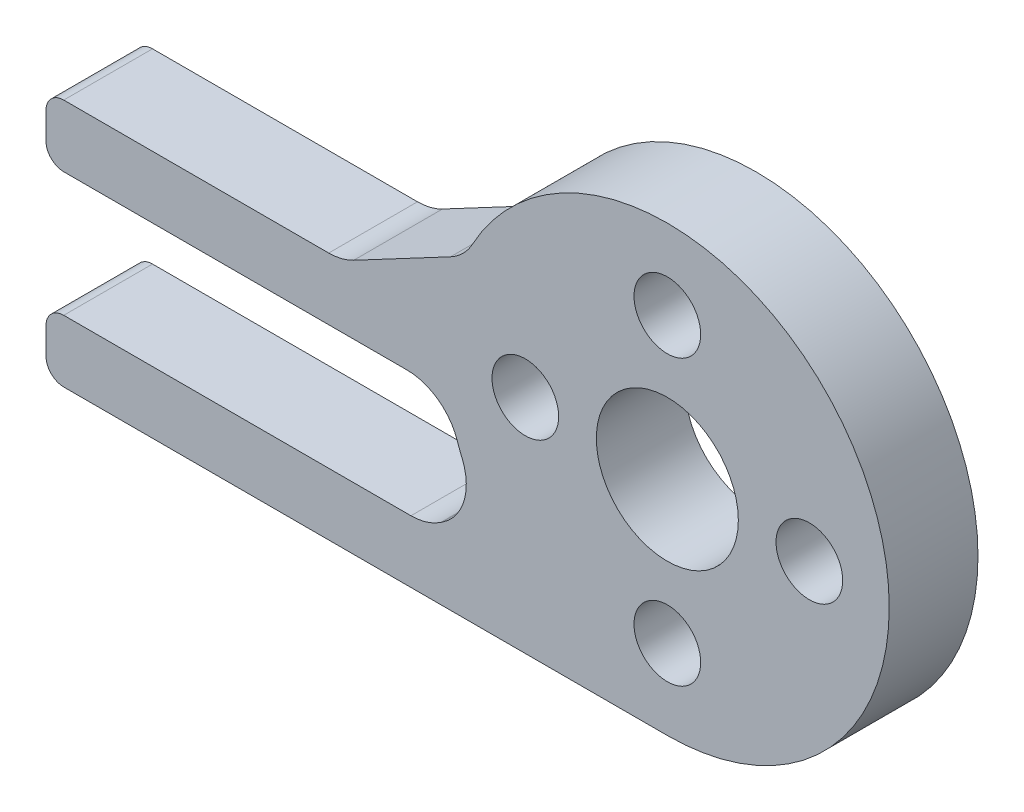
ISO-10303-21;
HEADER;
FILE_DESCRIPTION(('STEP AP214'),'2;1');
FILE_NAME('part.step','',(''),(''),'','','');
FILE_SCHEMA(('AUTOMOTIVE_DESIGN { 1 0 10303 214 1 1 1 1 }'));
ENDSEC;
DATA;
#1=APPLICATION_CONTEXT('core data for automotive mechanical design processes');
#2=APPLICATION_PROTOCOL_DEFINITION('international standard','automotive_design',2000,#1);
#3=PRODUCT_CONTEXT('',#1,'mechanical');
#4=PRODUCT('Part','Part','',(#3));
#5=PRODUCT_RELATED_PRODUCT_CATEGORY('part','',(#4));
#6=PRODUCT_DEFINITION_FORMATION('','',#4);
#7=PRODUCT_DEFINITION_CONTEXT('part definition',#1,'design');
#8=PRODUCT_DEFINITION('design','',#6,#7);
#9=PRODUCT_DEFINITION_SHAPE('','',#8);
#10=(LENGTH_UNIT() NAMED_UNIT(*) SI_UNIT(.MILLI.,.METRE.));
#11=(NAMED_UNIT(*) PLANE_ANGLE_UNIT() SI_UNIT($,.RADIAN.));
#12=(NAMED_UNIT(*) SI_UNIT($,.STERADIAN.) SOLID_ANGLE_UNIT());
#13=UNCERTAINTY_MEASURE_WITH_UNIT(LENGTH_MEASURE(1.E-05),#10,'distance_accuracy_value','');
#14=(GEOMETRIC_REPRESENTATION_CONTEXT(3) GLOBAL_UNCERTAINTY_ASSIGNED_CONTEXT((#13)) GLOBAL_UNIT_ASSIGNED_CONTEXT((#10,
#11,#12)) REPRESENTATION_CONTEXT('',''));
#15=CARTESIAN_POINT('',(0.,0.,0.));
#16=DIRECTION('',(0.,0.,1.));
#17=DIRECTION('',(1.,0.,0.));
#18=AXIS2_PLACEMENT_3D('',#15,#16,#17);
#19=CARTESIAN_POINT('',(0.,-2.,5.));
#20=DIRECTION('',(0.,1.,0.));
#21=DIRECTION('',(0.,0.,1.));
#22=AXIS2_PLACEMENT_3D('',#19,#20,#21);
#23=PLANE('',#22);
#24=DIRECTION('',(1.,0.,0.));
#25=VECTOR('',#24,1.);
#26=CARTESIAN_POINT('',(0.,-2.,5.));
#27=LINE('',#26,#25);
#28=CARTESIAN_POINT('',(-34.,-2.,5.));
#29=VERTEX_POINT('',#28);
#30=CARTESIAN_POINT('',(-14.6714007511212,-2.,5.));
#31=VERTEX_POINT('',#30);
#32=EDGE_CURVE('E334',#29,#31,#27,.T.);
#33=ORIENTED_EDGE('',*,*,#32,.F.);
#34=DIRECTION('',(0.,0.,-1.));
#35=VECTOR('',#34,1.);
#36=CARTESIAN_POINT('',(-34.,-2.,0.));
#37=LINE('',#36,#35);
#38=CARTESIAN_POINT('',(-34.,-2.,0.));
#39=VERTEX_POINT('',#38);
#40=EDGE_CURVE('E290',#29,#39,#37,.T.);
#41=ORIENTED_EDGE('',*,*,#40,.T.);
#42=DIRECTION('',(1.,0.,0.));
#43=VECTOR('',#42,1.);
#44=CARTESIAN_POINT('',(0.,-2.,0.));
#45=LINE('',#44,#43);
#46=CARTESIAN_POINT('',(-14.6714007511212,-2.,0.));
#47=VERTEX_POINT('',#46);
#48=EDGE_CURVE('E217',#39,#47,#45,.T.);
#49=ORIENTED_EDGE('',*,*,#48,.T.);
#50=DIRECTION('',(0.,0.,1.));
#51=VECTOR('',#50,1.);
#52=CARTESIAN_POINT('',(-14.6714007511212,-2.,5.));
#53=LINE('',#52,#51);
#54=EDGE_CURVE('E248',#47,#31,#53,.T.);
#55=ORIENTED_EDGE('',*,*,#54,.T.);
#56=EDGE_LOOP('',(#33,#41,#49,#55));
#57=FACE_BOUND('',#56,.T.);
#58=ADVANCED_FACE('F36',(#57),#23,.F.);
#59=CARTESIAN_POINT('',(0.,0.,5.));
#60=DIRECTION('',(0.,0.,-1.));
#61=DIRECTION('',(-1.,0.,0.));
#62=AXIS2_PLACEMENT_3D('',#59,#60,#61);
#63=CYLINDRICAL_SURFACE('',#62,12.5);
#64=CARTESIAN_POINT('',(0.,0.,5.));
#65=DIRECTION('',(0.,0.,1.));
#66=DIRECTION('',(1.,0.,0.));
#67=AXIS2_PLACEMENT_3D('',#64,#65,#66);
#68=CIRCLE('',#67,12.5);
#69=CARTESIAN_POINT('',(-11.8317747992913,-4.03225806451613,5.));
#70=VERTEX_POINT('',#69);
#71=CARTESIAN_POINT('',(-11.552219814128,-4.77453844534411,5.));
#72=VERTEX_POINT('',#71);
#73=EDGE_CURVE('E337',#70,#72,#68,.T.);
#74=ORIENTED_EDGE('',*,*,#73,.F.);
#75=DIRECTION('',(0.,0.,-1.));
#76=VECTOR('',#75,1.);
#77=CARTESIAN_POINT('',(-11.8317747992913,-4.03225806451613,5.));
#78=LINE('',#77,#76);
#79=CARTESIAN_POINT('',(-11.8317747992913,-4.03225806451613,0.));
#80=VERTEX_POINT('',#79);
#81=EDGE_CURVE('E245',#70,#80,#78,.T.);
#82=ORIENTED_EDGE('',*,*,#81,.T.);
#83=CARTESIAN_POINT('',(0.,0.,0.));
#84=DIRECTION('',(0.,0.,1.));
#85=DIRECTION('',(1.,0.,0.));
#86=AXIS2_PLACEMENT_3D('',#83,#84,#85);
#87=CIRCLE('',#86,12.5);
#88=CARTESIAN_POINT('',(-11.552219814128,-4.77453844534411,0.));
#89=VERTEX_POINT('',#88);
#90=EDGE_CURVE('E219',#80,#89,#87,.T.);
#91=ORIENTED_EDGE('',*,*,#90,.T.);
#92=DIRECTION('',(0.,0.,-1.));
#93=VECTOR('',#92,1.);
#94=CARTESIAN_POINT('',(-11.552219814128,-4.77453844534411,5.));
#95=LINE('',#94,#93);
#96=EDGE_CURVE('E243',#89,#72,#95,.F.);
#97=ORIENTED_EDGE('',*,*,#96,.T.);
#98=EDGE_LOOP('',(#74,#82,#91,#97));
#99=FACE_BOUND('',#98,.T.);
#100=ADVANCED_FACE('F373',(#99),#63,.T.);
#101=CARTESIAN_POINT('',(-0.0737973544000701,0.108951106767535,5.));
#102=DIRECTION('',(0.560805253983268,-0.827947744187254,0.));
#103=DIRECTION('',(0.827947744187254,0.560805253983268,0.));
#104=AXIS2_PLACEMENT_3D('',#101,#102,#103);
#105=PLANE('',#104);
#106=DIRECTION('',(-0.827947744187254,-0.560805253983268,0.));
#107=VECTOR('',#106,1.);
#108=CARTESIAN_POINT('',(-0.0737973544000701,0.108951106767535,5.));
#109=LINE('',#108,#107);
#110=CARTESIAN_POINT('',(-12.6423368075689,-8.40427090478847,5.));
#111=VERTEX_POINT('',#110);
#112=CARTESIAN_POINT('',(-12.7598138262161,-8.48384323256177,5.));
#113=VERTEX_POINT('',#112);
#114=EDGE_CURVE('E341',#111,#113,#109,.T.);
#115=ORIENTED_EDGE('',*,*,#114,.F.);
#116=DIRECTION('',(0.,0.,1.));
#117=VECTOR('',#116,1.);
#118=CARTESIAN_POINT('',(-12.6423368075689,-8.40427090478846,0.));
#119=LINE('',#118,#117);
#120=CARTESIAN_POINT('',(-12.6423368075689,-8.40427090478847,0.));
#121=VERTEX_POINT('',#120);
#122=EDGE_CURVE('E253',#111,#121,#119,.F.);
#123=ORIENTED_EDGE('',*,*,#122,.T.);
#124=DIRECTION('',(-0.827947744187254,-0.560805253983268,0.));
#125=VECTOR('',#124,1.);
#126=CARTESIAN_POINT('',(-0.0737973544000701,0.108951106767535,0.));
#127=LINE('',#126,#125);
#128=CARTESIAN_POINT('',(-12.7598138262161,-8.48384323256177,0.));
#129=VERTEX_POINT('',#128);
#130=EDGE_CURVE('E222',#121,#129,#127,.T.);
#131=ORIENTED_EDGE('',*,*,#130,.T.);
#132=DIRECTION('',(0.,0.,-1.));
#133=VECTOR('',#132,1.);
#134=CARTESIAN_POINT('',(-12.7598138262161,-8.48384323256177,5.));
#135=LINE('',#134,#133);
#136=EDGE_CURVE('E251',#129,#113,#135,.F.);
#137=ORIENTED_EDGE('',*,*,#136,.T.);
#138=EDGE_LOOP('',(#115,#123,#131,#137));
#139=FACE_BOUND('',#138,.T.);
#140=ADVANCED_FACE('F364',(#139),#105,.F.);
#141=CARTESIAN_POINT('',(0.,-9.00000000000001,5.));
#142=DIRECTION('',(0.,1.,0.));
#143=DIRECTION('',(0.,0.,1.));
#144=AXIS2_PLACEMENT_3D('',#141,#142,#143);
#145=PLANE('',#144);
#146=DIRECTION('',(1.,0.,0.));
#147=VECTOR('',#146,1.);
#148=CARTESIAN_POINT('',(0.,-9.00000000000001,0.));
#149=LINE('',#148,#147);
#150=CARTESIAN_POINT('',(-34.,-9.00000000000001,0.));
#151=VERTEX_POINT('',#150);
#152=CARTESIAN_POINT('',(-14.4422295881659,-9.00000000000001,0.));
#153=VERTEX_POINT('',#152);
#154=EDGE_CURVE('E225',#151,#153,#149,.T.);
#155=ORIENTED_EDGE('',*,*,#154,.F.);
#156=DIRECTION('',(0.,0.,-1.));
#157=VECTOR('',#156,1.);
#158=CARTESIAN_POINT('',(-34.,-9.00000000000001,5.));
#159=LINE('',#158,#157);
#160=CARTESIAN_POINT('',(-34.,-9.00000000000001,5.));
#161=VERTEX_POINT('',#160);
#162=EDGE_CURVE('E307',#151,#161,#159,.F.);
#163=ORIENTED_EDGE('',*,*,#162,.T.);
#164=DIRECTION('',(1.,0.,0.));
#165=VECTOR('',#164,1.);
#166=CARTESIAN_POINT('',(0.,-9.00000000000001,5.));
#167=LINE('',#166,#165);
#168=CARTESIAN_POINT('',(-14.4422295881659,-9.00000000000001,5.));
#169=VERTEX_POINT('',#168);
#170=EDGE_CURVE('E196',#161,#169,#167,.T.);
#171=ORIENTED_EDGE('',*,*,#170,.T.);
#172=DIRECTION('',(0.,0.,-1.));
#173=VECTOR('',#172,1.);
#174=CARTESIAN_POINT('',(-14.4422295881659,-9.00000000000001,5.));
#175=LINE('',#174,#173);
#176=EDGE_CURVE('E256',#169,#153,#175,.T.);
#177=ORIENTED_EDGE('',*,*,#176,.T.);
#178=EDGE_LOOP('',(#155,#163,#171,#177));
#179=FACE_BOUND('',#178,.T.);
#180=ADVANCED_FACE('F352',(#179),#145,.T.);
#181=CARTESIAN_POINT('',(-35.,0.,5.));
#182=DIRECTION('',(-1.,0.,0.));
#183=DIRECTION('',(0.,0.,1.));
#184=AXIS2_PLACEMENT_3D('',#181,#182,#183);
#185=PLANE('',#184);
#186=DIRECTION('',(0.,1.,0.));
#187=VECTOR('',#186,1.);
#188=CARTESIAN_POINT('',(-35.,0.,0.));
#189=LINE('',#188,#187);
#190=CARTESIAN_POINT('',(-35.,-11.5,0.));
#191=VERTEX_POINT('',#190);
#192=CARTESIAN_POINT('',(-35.,-10.,0.));
#193=VERTEX_POINT('',#192);
#194=EDGE_CURVE('E227',#191,#193,#189,.T.);
#195=ORIENTED_EDGE('',*,*,#194,.F.);
#196=DIRECTION('',(0.,0.,-1.));
#197=VECTOR('',#196,1.);
#198=CARTESIAN_POINT('',(-35.,-11.5,5.));
#199=LINE('',#198,#197);
#200=CARTESIAN_POINT('',(-35.,-11.5,5.));
#201=VERTEX_POINT('',#200);
#202=EDGE_CURVE('E315',#191,#201,#199,.F.);
#203=ORIENTED_EDGE('',*,*,#202,.T.);
#204=DIRECTION('',(0.,1.,0.));
#205=VECTOR('',#204,1.);
#206=CARTESIAN_POINT('',(-35.,0.,5.));
#207=LINE('',#206,#205);
#208=CARTESIAN_POINT('',(-35.,-10.,5.));
#209=VERTEX_POINT('',#208);
#210=EDGE_CURVE('E194',#201,#209,#207,.T.);
#211=ORIENTED_EDGE('',*,*,#210,.T.);
#212=DIRECTION('',(0.,0.,-1.));
#213=VECTOR('',#212,1.);
#214=CARTESIAN_POINT('',(-35.,-10.,5.));
#215=LINE('',#214,#213);
#216=EDGE_CURVE('E304',#209,#193,#215,.T.);
#217=ORIENTED_EDGE('',*,*,#216,.T.);
#218=EDGE_LOOP('',(#195,#203,#211,#217));
#219=FACE_BOUND('',#218,.T.);
#220=ADVANCED_FACE('F450',(#219),#185,.T.);
#221=CARTESIAN_POINT('',(0.,-12.5,5.));
#222=DIRECTION('',(0.,-1.,0.));
#223=DIRECTION('',(0.,0.,-1.));
#224=AXIS2_PLACEMENT_3D('',#221,#222,#223);
#225=PLANE('',#224);
#226=DIRECTION('',(-1.,0.,0.));
#227=VECTOR('',#226,1.);
#228=CARTESIAN_POINT('',(0.,-12.5,5.));
#229=LINE('',#228,#227);
#230=CARTESIAN_POINT('',(0.,-12.5,5.));
#231=VERTEX_POINT('',#230);
#232=CARTESIAN_POINT('',(-34.,-12.5,5.));
#233=VERTEX_POINT('',#232);
#234=EDGE_CURVE('E172',#231,#233,#229,.T.);
#235=ORIENTED_EDGE('',*,*,#234,.T.);
#236=DIRECTION('',(0.,0.,-1.));
#237=VECTOR('',#236,1.);
#238=CARTESIAN_POINT('',(-34.,-12.5,5.));
#239=LINE('',#238,#237);
#240=CARTESIAN_POINT('',(-34.,-12.5,0.));
#241=VERTEX_POINT('',#240);
#242=EDGE_CURVE('E309',#233,#241,#239,.T.);
#243=ORIENTED_EDGE('',*,*,#242,.T.);
#244=DIRECTION('',(-1.,0.,0.));
#245=VECTOR('',#244,1.);
#246=CARTESIAN_POINT('',(0.,-12.5,0.));
#247=LINE('',#246,#245);
#248=CARTESIAN_POINT('',(0.,-12.5,0.));
#249=VERTEX_POINT('',#248);
#250=EDGE_CURVE('E175',#249,#241,#247,.T.);
#251=ORIENTED_EDGE('',*,*,#250,.F.);
#252=DIRECTION('',(0.,0.,-1.));
#253=VECTOR('',#252,1.);
#254=CARTESIAN_POINT('',(0.,-12.5,5.));
#255=LINE('',#254,#253);
#256=EDGE_CURVE('E167',#231,#249,#255,.T.);
#257=ORIENTED_EDGE('',*,*,#256,.F.);
#258=EDGE_LOOP('',(#235,#243,#251,#257));
#259=FACE_BOUND('',#258,.T.);
#260=ADVANCED_FACE('F169',(#259),#225,.T.);
#261=CARTESIAN_POINT('',(0.,0.,5.));
#262=DIRECTION('',(0.,0.,-1.));
#263=DIRECTION('',(-1.,0.,0.));
#264=AXIS2_PLACEMENT_3D('',#261,#262,#263);
#265=CYLINDRICAL_SURFACE('',#264,12.5);
#266=CARTESIAN_POINT('',(0.,0.,0.));
#267=DIRECTION('',(0.,0.,1.));
#268=DIRECTION('',(1.,0.,0.));
#269=AXIS2_PLACEMENT_3D('',#266,#267,#268);
#270=CIRCLE('',#269,12.5);
#271=CARTESIAN_POINT('',(-10.9853032448127,5.96431996287154,0.));
#272=VERTEX_POINT('',#271);
#273=EDGE_CURVE('E230',#249,#272,#270,.T.);
#274=ORIENTED_EDGE('',*,*,#273,.T.);
#275=DIRECTION('',(0.,0.,-1.));
#276=VECTOR('',#275,1.);
#277=CARTESIAN_POINT('',(-10.9853032448127,5.96431996287154,5.));
#278=LINE('',#277,#276);
#279=CARTESIAN_POINT('',(-10.9853032448127,5.96431996287154,5.));
#280=VERTEX_POINT('',#279);
#281=EDGE_CURVE('E187',#272,#280,#278,.F.);
#282=ORIENTED_EDGE('',*,*,#281,.T.);
#283=CARTESIAN_POINT('',(0.,0.,5.));
#284=DIRECTION('',(0.,0.,1.));
#285=DIRECTION('',(1.,0.,0.));
#286=AXIS2_PLACEMENT_3D('',#283,#284,#285);
#287=CIRCLE('',#286,12.5);
#288=EDGE_CURVE('E184',#231,#280,#287,.T.);
#289=ORIENTED_EDGE('',*,*,#288,.F.);
#290=ORIENTED_EDGE('',*,*,#256,.T.);
#291=EDGE_LOOP('',(#274,#282,#289,#290));
#292=FACE_BOUND('',#291,.T.);
#293=ADVANCED_FACE('F185',(#292),#265,.T.);
#294=CARTESIAN_POINT('',(0.,1.5,5.));
#295=DIRECTION('',(0.,1.,0.));
#296=DIRECTION('',(0.,0.,1.));
#297=AXIS2_PLACEMENT_3D('',#294,#295,#296);
#298=PLANE('',#297);
#299=DIRECTION('',(1.,0.,0.));
#300=VECTOR('',#299,1.);
#301=CARTESIAN_POINT('',(0.,1.5,0.));
#302=LINE('',#301,#300);
#303=CARTESIAN_POINT('',(-34.,1.5,0.));
#304=VERTEX_POINT('',#303);
#305=CARTESIAN_POINT('',(-19.0743537304339,1.5,0.));
#306=VERTEX_POINT('',#305);
#307=EDGE_CURVE('E232',#304,#306,#302,.T.);
#308=ORIENTED_EDGE('',*,*,#307,.F.);
#309=DIRECTION('',(0.,0.,-1.));
#310=VECTOR('',#309,1.);
#311=CARTESIAN_POINT('',(-34.,1.5,5.));
#312=LINE('',#311,#310);
#313=CARTESIAN_POINT('',(-34.,1.5,5.));
#314=VERTEX_POINT('',#313);
#315=EDGE_CURVE('E11',#304,#314,#312,.F.);
#316=ORIENTED_EDGE('',*,*,#315,.T.);
#317=DIRECTION('',(1.,0.,0.));
#318=VECTOR('',#317,1.);
#319=CARTESIAN_POINT('',(0.,1.5,5.));
#320=LINE('',#319,#318);
#321=CARTESIAN_POINT('',(-19.0743537304339,1.5,5.));
#322=VERTEX_POINT('',#321);
#323=EDGE_CURVE('E188',#314,#322,#320,.T.);
#324=ORIENTED_EDGE('',*,*,#323,.T.);
#325=DIRECTION('',(0.,0.,-1.));
#326=VECTOR('',#325,1.);
#327=CARTESIAN_POINT('',(-19.0743537304339,1.5,5.));
#328=LINE('',#327,#326);
#329=EDGE_CURVE('E278',#322,#306,#328,.T.);
#330=ORIENTED_EDGE('',*,*,#329,.T.);
#331=EDGE_LOOP('',(#308,#316,#324,#330));
#332=FACE_BOUND('',#331,.T.);
#333=ADVANCED_FACE('F399',(#332),#298,.T.);
#334=CARTESIAN_POINT('',(0.,0.,5.));
#335=DIRECTION('',(0.,0.,-1.));
#336=DIRECTION('',(-1.,0.,0.));
#337=AXIS2_PLACEMENT_3D('',#334,#335,#336);
#338=CYLINDRICAL_SURFACE('',#337,4.);
#339=CARTESIAN_POINT('',(0.,0.,5.));
#340=DIRECTION('',(0.,0.,1.));
#341=DIRECTION('',(1.,0.,0.));
#342=AXIS2_PLACEMENT_3D('',#339,#340,#341);
#343=CIRCLE('',#342,4.);
#344=CARTESIAN_POINT('',(4.,0.,5.));
#345=VERTEX_POINT('',#344);
#346=EDGE_CURVE('E338',#345,#345,#343,.T.);
#347=ORIENTED_EDGE('',*,*,#346,.T.);
#348=EDGE_LOOP('',(#347));
#349=FACE_BOUND('',#348,.T.);
#350=CARTESIAN_POINT('',(0.,0.,0.));
#351=DIRECTION('',(0.,0.,1.));
#352=DIRECTION('',(1.,0.,0.));
#353=AXIS2_PLACEMENT_3D('',#350,#351,#352);
#354=CIRCLE('',#353,4.);
#355=CARTESIAN_POINT('',(4.,0.,0.));
#356=VERTEX_POINT('',#355);
#357=EDGE_CURVE('E214',#356,#356,#354,.T.);
#358=ORIENTED_EDGE('',*,*,#357,.F.);
#359=EDGE_LOOP('',(#358));
#360=FACE_BOUND('',#359,.T.);
#361=ADVANCED_FACE('F395',(#349,#360),#338,.F.);
#362=CARTESIAN_POINT('',(-7.99999999999977,-2.27373675443232E-13,5.));
#363=DIRECTION('',(0.,0.,-1.));
#364=DIRECTION('',(-1.,0.,0.));
#365=AXIS2_PLACEMENT_3D('',#362,#363,#364);
#366=CYLINDRICAL_SURFACE('',#365,1.87800000000036);
#367=CARTESIAN_POINT('',(-7.99999999999977,-2.27373675443232E-13,5.));
#368=DIRECTION('',(0.,0.,1.));
#369=DIRECTION('',(1.,0.,0.));
#370=AXIS2_PLACEMENT_3D('',#367,#368,#369);
#371=CIRCLE('',#370,1.87800000000036);
#372=CARTESIAN_POINT('',(-6.12199999999941,-2.27373675443232E-13,5.));
#373=VERTEX_POINT('',#372);
#374=EDGE_CURVE('E344',#373,#373,#371,.T.);
#375=ORIENTED_EDGE('',*,*,#374,.T.);
#376=EDGE_LOOP('',(#375));
#377=FACE_BOUND('',#376,.T.);
#378=CARTESIAN_POINT('',(-7.99999999999977,-2.27373675443232E-13,0.));
#379=DIRECTION('',(0.,0.,1.));
#380=DIRECTION('',(1.,0.,0.));
#381=AXIS2_PLACEMENT_3D('',#378,#379,#380);
#382=CIRCLE('',#381,1.87800000000036);
#383=CARTESIAN_POINT('',(-6.12199999999941,-2.27373675443232E-13,0.));
#384=VERTEX_POINT('',#383);
#385=EDGE_CURVE('E211',#384,#384,#382,.T.);
#386=ORIENTED_EDGE('',*,*,#385,.F.);
#387=EDGE_LOOP('',(#386));
#388=FACE_BOUND('',#387,.T.);
#389=ADVANCED_FACE('F398',(#377,#388),#366,.F.);
#390=CARTESIAN_POINT('',(4.52787916007828E-13,-8.,5.));
#391=DIRECTION('',(0.,0.,-1.));
#392=DIRECTION('',(-1.,0.,0.));
#393=AXIS2_PLACEMENT_3D('',#390,#391,#392);
#394=CYLINDRICAL_SURFACE('',#393,1.87800000000049);
#395=CARTESIAN_POINT('',(4.52787916007828E-13,-8.,5.));
#396=DIRECTION('',(0.,0.,1.));
#397=DIRECTION('',(1.,0.,0.));
#398=AXIS2_PLACEMENT_3D('',#395,#396,#397);
#399=CIRCLE('',#398,1.87800000000049);
#400=CARTESIAN_POINT('',(1.87800000000094,-8.,5.));
#401=VERTEX_POINT('',#400);
#402=EDGE_CURVE('E650',#401,#401,#399,.T.);
#403=ORIENTED_EDGE('',*,*,#402,.T.);
#404=EDGE_LOOP('',(#403));
#405=FACE_BOUND('',#404,.T.);
#406=CARTESIAN_POINT('',(4.52787916007828E-13,-8.,0.));
#407=DIRECTION('',(0.,0.,1.));
#408=DIRECTION('',(1.,0.,0.));
#409=AXIS2_PLACEMENT_3D('',#406,#407,#408);
#410=CIRCLE('',#409,1.87800000000049);
#411=CARTESIAN_POINT('',(1.87800000000094,-8.,0.));
#412=VERTEX_POINT('',#411);
#413=EDGE_CURVE('E208',#412,#412,#410,.T.);
#414=ORIENTED_EDGE('',*,*,#413,.F.);
#415=EDGE_LOOP('',(#414));
#416=FACE_BOUND('',#415,.T.);
#417=ADVANCED_FACE('F403',(#405,#416),#394,.F.);
#418=CARTESIAN_POINT('',(8.00000000000023,2.26393958003914E-13,5.));
#419=DIRECTION('',(0.,0.,-1.));
#420=DIRECTION('',(-1.,0.,0.));
#421=AXIS2_PLACEMENT_3D('',#418,#419,#420);
#422=CYLINDRICAL_SURFACE('',#421,1.87800000000018);
#423=CARTESIAN_POINT('',(8.00000000000023,2.26393958003914E-13,5.));
#424=DIRECTION('',(0.,0.,1.));
#425=DIRECTION('',(1.,0.,0.));
#426=AXIS2_PLACEMENT_3D('',#423,#424,#425);
#427=CIRCLE('',#426,1.87800000000018);
#428=CARTESIAN_POINT('',(9.8780000000004,2.26393958003914E-13,5.));
#429=VERTEX_POINT('',#428);
#430=EDGE_CURVE('E646',#429,#429,#427,.T.);
#431=ORIENTED_EDGE('',*,*,#430,.T.);
#432=EDGE_LOOP('',(#431));
#433=FACE_BOUND('',#432,.T.);
#434=CARTESIAN_POINT('',(8.00000000000023,2.26393958003914E-13,0.));
#435=DIRECTION('',(0.,0.,1.));
#436=DIRECTION('',(1.,0.,0.));
#437=AXIS2_PLACEMENT_3D('',#434,#435,#436);
#438=CIRCLE('',#437,1.87800000000018);
#439=CARTESIAN_POINT('',(9.8780000000004,2.26393958003914E-13,0.));
#440=VERTEX_POINT('',#439);
#441=EDGE_CURVE('E205',#440,#440,#438,.T.);
#442=ORIENTED_EDGE('',*,*,#441,.F.);
#443=EDGE_LOOP('',(#442));
#444=FACE_BOUND('',#443,.T.);
#445=ADVANCED_FACE('F407',(#433,#444),#422,.F.);
#446=CARTESIAN_POINT('',(0.,8.,5.));
#447=DIRECTION('',(0.,0.,-1.));
#448=DIRECTION('',(-1.,0.,0.));
#449=AXIS2_PLACEMENT_3D('',#446,#447,#448);
#450=CYLINDRICAL_SURFACE('',#449,1.878);
#451=CARTESIAN_POINT('',(0.,8.,5.));
#452=DIRECTION('',(0.,0.,1.));
#453=DIRECTION('',(1.,0.,0.));
#454=AXIS2_PLACEMENT_3D('',#451,#452,#453);
#455=CIRCLE('',#454,1.878);
#456=CARTESIAN_POINT('',(1.878,8.,5.));
#457=VERTEX_POINT('',#456);
#458=EDGE_CURVE('E236',#457,#457,#455,.T.);
#459=ORIENTED_EDGE('',*,*,#458,.T.);
#460=EDGE_LOOP('',(#459));
#461=FACE_BOUND('',#460,.T.);
#462=CARTESIAN_POINT('',(0.,8.,0.));
#463=DIRECTION('',(0.,0.,1.));
#464=DIRECTION('',(1.,0.,0.));
#465=AXIS2_PLACEMENT_3D('',#462,#463,#464);
#466=CIRCLE('',#465,1.878);
#467=CARTESIAN_POINT('',(1.878,8.,0.));
#468=VERTEX_POINT('',#467);
#469=EDGE_CURVE('E202',#468,#468,#466,.T.);
#470=ORIENTED_EDGE('',*,*,#469,.F.);
#471=EDGE_LOOP('',(#470));
#472=FACE_BOUND('',#471,.T.);
#473=ADVANCED_FACE('F411',(#461,#472),#450,.F.);
#474=CARTESIAN_POINT('',(-35.,0.,5.));
#475=DIRECTION('',(-1.,0.,0.));
#476=DIRECTION('',(0.,0.,1.));
#477=AXIS2_PLACEMENT_3D('',#474,#475,#476);
#478=PLANE('',#477);
#479=DIRECTION('',(0.,1.,0.));
#480=VECTOR('',#479,1.);
#481=CARTESIAN_POINT('',(-35.,0.,5.));
#482=LINE('',#481,#480);
#483=CARTESIAN_POINT('',(-35.,-1.,5.));
#484=VERTEX_POINT('',#483);
#485=CARTESIAN_POINT('',(-35.,0.499999999999997,5.));
#486=VERTEX_POINT('',#485);
#487=EDGE_CURVE('E180',#484,#486,#482,.T.);
#488=ORIENTED_EDGE('',*,*,#487,.T.);
#489=DIRECTION('',(0.,0.,-1.));
#490=VECTOR('',#489,1.);
#491=CARTESIAN_POINT('',(-35.,0.499999999999997,5.));
#492=LINE('',#491,#490);
#493=CARTESIAN_POINT('',(-35.,0.499999999999997,0.));
#494=VERTEX_POINT('',#493);
#495=EDGE_CURVE('E44',#486,#494,#492,.T.);
#496=ORIENTED_EDGE('',*,*,#495,.T.);
#497=DIRECTION('',(0.,1.,0.));
#498=VECTOR('',#497,1.);
#499=CARTESIAN_POINT('',(-35.,0.,0.));
#500=LINE('',#499,#498);
#501=CARTESIAN_POINT('',(-35.,-1.,0.));
#502=VERTEX_POINT('',#501);
#503=EDGE_CURVE('E234',#502,#494,#500,.T.);
#504=ORIENTED_EDGE('',*,*,#503,.F.);
#505=DIRECTION('',(0.,0.,-1.));
#506=VECTOR('',#505,1.);
#507=CARTESIAN_POINT('',(-35.,-1.,5.));
#508=LINE('',#507,#506);
#509=EDGE_CURVE('E297',#502,#484,#508,.F.);
#510=ORIENTED_EDGE('',*,*,#509,.T.);
#511=EDGE_LOOP('',(#488,#496,#504,#510));
#512=FACE_BOUND('',#511,.T.);
#513=ADVANCED_FACE('F322',(#512),#478,.T.);
#514=CARTESIAN_POINT('',(0.,0.,5.));
#515=DIRECTION('',(0.,0.,1.));
#516=DIRECTION('',(1.,0.,0.));
#517=AXIS2_PLACEMENT_3D('',#514,#515,#516);
#518=PLANE('',#517);
#519=ORIENTED_EDGE('',*,*,#458,.F.);
#520=EDGE_LOOP('',(#519));
#521=FACE_BOUND('',#520,.T.);
#522=ORIENTED_EDGE('',*,*,#430,.F.);
#523=EDGE_LOOP('',(#522));
#524=FACE_BOUND('',#523,.T.);
#525=ORIENTED_EDGE('',*,*,#402,.F.);
#526=EDGE_LOOP('',(#525));
#527=FACE_BOUND('',#526,.T.);
#528=ORIENTED_EDGE('',*,*,#374,.F.);
#529=EDGE_LOOP('',(#528));
#530=FACE_BOUND('',#529,.T.);
#531=ORIENTED_EDGE('',*,*,#346,.F.);
#532=EDGE_LOOP('',(#531));
#533=FACE_BOUND('',#532,.T.);
#534=ORIENTED_EDGE('',*,*,#210,.F.);
#535=CARTESIAN_POINT('',(-34.,-11.5,5.));
#536=DIRECTION('',(0.,0.,1.));
#537=DIRECTION('',(1.,0.,0.));
#538=AXIS2_PLACEMENT_3D('',#535,#536,#537);
#539=CIRCLE('',#538,1.);
#540=EDGE_CURVE('E193',#201,#233,#539,.T.);
#541=ORIENTED_EDGE('',*,*,#540,.T.);
#542=ORIENTED_EDGE('',*,*,#234,.F.);
#543=ORIENTED_EDGE('',*,*,#288,.T.);
#544=CARTESIAN_POINT('',(-13.6217760235677,7.39575675396071,5.));
#545=DIRECTION('',(0.,0.,1.));
#546=DIRECTION('',(1.,0.,0.));
#547=AXIS2_PLACEMENT_3D('',#544,#545,#546);
#548=CIRCLE('',#547,3.);
#549=CARTESIAN_POINT('',(-12.214660961499,4.74622336068193,5.));
#550=VERTEX_POINT('',#549);
#551=EDGE_CURVE('E281',#280,#550,#548,.F.);
#552=ORIENTED_EDGE('',*,*,#551,.T.);
#553=DIRECTION('',(-0.883177797759594,-0.469038354022903,0.));
#554=VECTOR('',#553,1.);
#555=CARTESIAN_POINT('',(-18.3271512816037,1.5,5.));
#556=LINE('',#555,#554);
#557=CARTESIAN_POINT('',(-17.6672386683652,1.85046660672121,5.));
#558=VERTEX_POINT('',#557);
#559=EDGE_CURVE('E240',#550,#558,#556,.T.);
#560=ORIENTED_EDGE('',*,*,#559,.T.);
#561=CARTESIAN_POINT('',(-19.0743537304339,4.5,5.));
#562=DIRECTION('',(0.,0.,1.));
#563=DIRECTION('',(1.,0.,0.));
#564=AXIS2_PLACEMENT_3D('',#561,#562,#563);
#565=CIRCLE('',#564,3.);
#566=EDGE_CURVE('E287',#558,#322,#565,.F.);
#567=ORIENTED_EDGE('',*,*,#566,.T.);
#568=ORIENTED_EDGE('',*,*,#323,.F.);
#569=CARTESIAN_POINT('',(-34.,0.499999999999997,5.));
#570=DIRECTION('',(0.,0.,1.));
#571=DIRECTION('',(1.,0.,0.));
#572=AXIS2_PLACEMENT_3D('',#569,#570,#571);
#573=CIRCLE('',#572,1.);
#574=EDGE_CURVE('E56',#314,#486,#573,.T.);
#575=ORIENTED_EDGE('',*,*,#574,.T.);
#576=ORIENTED_EDGE('',*,*,#487,.F.);
#577=CARTESIAN_POINT('',(-34.,-1.,5.));
#578=DIRECTION('',(0.,0.,1.));
#579=DIRECTION('',(1.,0.,0.));
#580=AXIS2_PLACEMENT_3D('',#577,#578,#579);
#581=CIRCLE('',#580,1.);
#582=EDGE_CURVE('E302',#484,#29,#581,.T.);
#583=ORIENTED_EDGE('',*,*,#582,.T.);
#584=ORIENTED_EDGE('',*,*,#32,.T.);
#585=CARTESIAN_POINT('',(-14.6714007511212,-5.,5.));
#586=DIRECTION('',(0.,0.,1.));
#587=DIRECTION('',(1.,0.,0.));
#588=AXIS2_PLACEMENT_3D('',#585,#586,#587);
#589=CIRCLE('',#588,3.);
#590=EDGE_CURVE('E262',#31,#70,#589,.F.);
#591=ORIENTED_EDGE('',*,*,#590,.T.);
#592=ORIENTED_EDGE('',*,*,#73,.T.);
#593=CARTESIAN_POINT('',(-14.3247525695187,-5.9204276722267,5.));
#594=DIRECTION('',(0.,0.,1.));
#595=DIRECTION('',(1.,0.,0.));
#596=AXIS2_PLACEMENT_3D('',#593,#594,#595);
#597=CIRCLE('',#596,3.);
#598=EDGE_CURVE('E266',#72,#111,#597,.F.);
#599=ORIENTED_EDGE('',*,*,#598,.T.);
#600=ORIENTED_EDGE('',*,*,#114,.T.);
#601=CARTESIAN_POINT('',(-14.4422295881659,-6.,5.));
#602=DIRECTION('',(0.,0.,1.));
#603=DIRECTION('',(1.,0.,0.));
#604=AXIS2_PLACEMENT_3D('',#601,#602,#603);
#605=CIRCLE('',#604,3.);
#606=EDGE_CURVE('E270',#113,#169,#605,.F.);
#607=ORIENTED_EDGE('',*,*,#606,.T.);
#608=ORIENTED_EDGE('',*,*,#170,.F.);
#609=CARTESIAN_POINT('',(-34.,-10.,5.));
#610=DIRECTION('',(0.,0.,1.));
#611=DIRECTION('',(1.,0.,0.));
#612=AXIS2_PLACEMENT_3D('',#609,#610,#611);
#613=CIRCLE('',#612,1.);
#614=EDGE_CURVE('E299',#161,#209,#613,.T.);
#615=ORIENTED_EDGE('',*,*,#614,.T.);
#616=EDGE_LOOP('',(#534,#541,#542,#543,#552,#560,#567,#568,#575,#576,#583,#584,#591,#592,#599,
#600,#607,#608,#615));
#617=FACE_BOUND('',#616,.T.);
#618=ADVANCED_FACE('F191',(#521,#524,#527,#530,#533,#617),#518,.T.);
#619=CARTESIAN_POINT('',(0.,0.,0.));
#620=DIRECTION('',(0.,0.,1.));
#621=DIRECTION('',(1.,0.,0.));
#622=AXIS2_PLACEMENT_3D('',#619,#620,#621);
#623=PLANE('',#622);
#624=ORIENTED_EDGE('',*,*,#469,.T.);
#625=EDGE_LOOP('',(#624));
#626=FACE_BOUND('',#625,.T.);
#627=ORIENTED_EDGE('',*,*,#441,.T.);
#628=EDGE_LOOP('',(#627));
#629=FACE_BOUND('',#628,.T.);
#630=ORIENTED_EDGE('',*,*,#413,.T.);
#631=EDGE_LOOP('',(#630));
#632=FACE_BOUND('',#631,.T.);
#633=ORIENTED_EDGE('',*,*,#385,.T.);
#634=EDGE_LOOP('',(#633));
#635=FACE_BOUND('',#634,.T.);
#636=ORIENTED_EDGE('',*,*,#357,.T.);
#637=EDGE_LOOP('',(#636));
#638=FACE_BOUND('',#637,.T.);
#639=ORIENTED_EDGE('',*,*,#250,.T.);
#640=CARTESIAN_POINT('',(-34.,-11.5,0.));
#641=DIRECTION('',(0.,0.,1.));
#642=DIRECTION('',(1.,0.,0.));
#643=AXIS2_PLACEMENT_3D('',#640,#641,#642);
#644=CIRCLE('',#643,1.);
#645=EDGE_CURVE('E313',#241,#191,#644,.F.);
#646=ORIENTED_EDGE('',*,*,#645,.T.);
#647=ORIENTED_EDGE('',*,*,#194,.T.);
#648=CARTESIAN_POINT('',(-34.,-10.,0.));
#649=DIRECTION('',(0.,0.,1.));
#650=DIRECTION('',(1.,0.,0.));
#651=AXIS2_PLACEMENT_3D('',#648,#649,#650);
#652=CIRCLE('',#651,1.);
#653=EDGE_CURVE('E293',#193,#151,#652,.F.);
#654=ORIENTED_EDGE('',*,*,#653,.T.);
#655=ORIENTED_EDGE('',*,*,#154,.T.);
#656=CARTESIAN_POINT('',(-14.4422295881659,-6.,0.));
#657=DIRECTION('',(0.,0.,1.));
#658=DIRECTION('',(1.,0.,0.));
#659=AXIS2_PLACEMENT_3D('',#656,#657,#658);
#660=CIRCLE('',#659,3.);
#661=EDGE_CURVE('E268',#153,#129,#660,.T.);
#662=ORIENTED_EDGE('',*,*,#661,.T.);
#663=ORIENTED_EDGE('',*,*,#130,.F.);
#664=CARTESIAN_POINT('',(-14.3247525695187,-5.9204276722267,0.));
#665=DIRECTION('',(0.,0.,1.));
#666=DIRECTION('',(1.,0.,0.));
#667=AXIS2_PLACEMENT_3D('',#664,#665,#666);
#668=CIRCLE('',#667,3.);
#669=EDGE_CURVE('E264',#121,#89,#668,.T.);
#670=ORIENTED_EDGE('',*,*,#669,.T.);
#671=ORIENTED_EDGE('',*,*,#90,.F.);
#672=CARTESIAN_POINT('',(-14.6714007511212,-5.,0.));
#673=DIRECTION('',(0.,0.,1.));
#674=DIRECTION('',(1.,0.,0.));
#675=AXIS2_PLACEMENT_3D('',#672,#673,#674);
#676=CIRCLE('',#675,3.);
#677=EDGE_CURVE('E259',#80,#47,#676,.T.);
#678=ORIENTED_EDGE('',*,*,#677,.T.);
#679=ORIENTED_EDGE('',*,*,#48,.F.);
#680=CARTESIAN_POINT('',(-34.,-1.,0.));
#681=DIRECTION('',(0.,0.,1.));
#682=DIRECTION('',(1.,0.,0.));
#683=AXIS2_PLACEMENT_3D('',#680,#681,#682);
#684=CIRCLE('',#683,1.);
#685=EDGE_CURVE('E295',#39,#502,#684,.F.);
#686=ORIENTED_EDGE('',*,*,#685,.T.);
#687=ORIENTED_EDGE('',*,*,#503,.T.);
#688=CARTESIAN_POINT('',(-34.,0.499999999999997,0.));
#689=DIRECTION('',(0.,0.,1.));
#690=DIRECTION('',(1.,0.,0.));
#691=AXIS2_PLACEMENT_3D('',#688,#689,#690);
#692=CIRCLE('',#691,1.);
#693=EDGE_CURVE('E311',#494,#304,#692,.F.);
#694=ORIENTED_EDGE('',*,*,#693,.T.);
#695=ORIENTED_EDGE('',*,*,#307,.T.);
#696=CARTESIAN_POINT('',(-19.0743537304339,4.5,0.));
#697=DIRECTION('',(0.,0.,1.));
#698=DIRECTION('',(1.,0.,0.));
#699=AXIS2_PLACEMENT_3D('',#696,#697,#698);
#700=CIRCLE('',#699,3.);
#701=CARTESIAN_POINT('',(-17.6672386683652,1.85046660672121,0.));
#702=VERTEX_POINT('',#701);
#703=EDGE_CURVE('E285',#306,#702,#700,.T.);
#704=ORIENTED_EDGE('',*,*,#703,.T.);
#705=DIRECTION('',(0.883177797759594,0.469038354022903,0.));
#706=VECTOR('',#705,1.);
#707=CARTESIAN_POINT('',(-4.65328427980997,8.76192176469909,0.));
#708=LINE('',#707,#706);
#709=CARTESIAN_POINT('',(-12.214660961499,4.74622336068193,0.));
#710=VERTEX_POINT('',#709);
#711=EDGE_CURVE('E179',#702,#710,#708,.T.);
#712=ORIENTED_EDGE('',*,*,#711,.T.);
#713=CARTESIAN_POINT('',(-13.6217760235677,7.39575675396071,0.));
#714=DIRECTION('',(0.,0.,1.));
#715=DIRECTION('',(1.,0.,0.));
#716=AXIS2_PLACEMENT_3D('',#713,#714,#715);
#717=CIRCLE('',#716,3.);
#718=EDGE_CURVE('E283',#710,#272,#717,.T.);
#719=ORIENTED_EDGE('',*,*,#718,.T.);
#720=ORIENTED_EDGE('',*,*,#273,.F.);
#721=EDGE_LOOP('',(#639,#646,#647,#654,#655,#662,#663,#670,#671,#678,#679,#686,#687,#694,#695,
#704,#712,#719,#720));
#722=FACE_BOUND('',#721,.T.);
#723=ADVANCED_FACE('F326',(#626,#629,#632,#635,#638,#722),#623,.F.);
#724=CARTESIAN_POINT('',(-18.3271512816037,1.5,5.));
#725=DIRECTION('',(0.469038354022903,-0.883177797759594,0.));
#726=DIRECTION('',(0.,0.,-1.));
#727=AXIS2_PLACEMENT_3D('',#724,#725,#726);
#728=PLANE('',#727);
#729=ORIENTED_EDGE('',*,*,#559,.F.);
#730=DIRECTION('',(0.,0.,1.));
#731=VECTOR('',#730,1.);
#732=CARTESIAN_POINT('',(-12.214660961499,4.74622336068193,0.));
#733=LINE('',#732,#731);
#734=EDGE_CURVE('E276',#550,#710,#733,.F.);
#735=ORIENTED_EDGE('',*,*,#734,.T.);
#736=ORIENTED_EDGE('',*,*,#711,.F.);
#737=DIRECTION('',(0.,0.,-1.));
#738=VECTOR('',#737,1.);
#739=CARTESIAN_POINT('',(-17.6672386683652,1.85046660672121,5.));
#740=LINE('',#739,#738);
#741=EDGE_CURVE('E274',#702,#558,#740,.F.);
#742=ORIENTED_EDGE('',*,*,#741,.T.);
#743=EDGE_LOOP('',(#729,#735,#736,#742));
#744=FACE_BOUND('',#743,.T.);
#745=ADVANCED_FACE('F378',(#744),#728,.F.);
#746=CARTESIAN_POINT('',(-14.6714007511212,-5.,5.));
#747=DIRECTION('',(0.,0.,-1.));
#748=DIRECTION('',(-1.,0.,0.));
#749=AXIS2_PLACEMENT_3D('',#746,#747,#748);
#750=CYLINDRICAL_SURFACE('',#749,3.);
#751=ORIENTED_EDGE('',*,*,#590,.F.);
#752=ORIENTED_EDGE('',*,*,#54,.F.);
#753=ORIENTED_EDGE('',*,*,#677,.F.);
#754=ORIENTED_EDGE('',*,*,#81,.F.);
#755=EDGE_LOOP('',(#751,#752,#753,#754));
#756=FACE_BOUND('',#755,.T.);
#757=ADVANCED_FACE('F376',(#756),#750,.F.);
#758=CARTESIAN_POINT('',(-14.3247525695187,-5.9204276722267,5.));
#759=DIRECTION('',(0.,0.,-1.));
#760=DIRECTION('',(-1.,0.,0.));
#761=AXIS2_PLACEMENT_3D('',#758,#759,#760);
#762=CYLINDRICAL_SURFACE('',#761,3.);
#763=ORIENTED_EDGE('',*,*,#598,.F.);
#764=ORIENTED_EDGE('',*,*,#96,.F.);
#765=ORIENTED_EDGE('',*,*,#669,.F.);
#766=ORIENTED_EDGE('',*,*,#122,.F.);
#767=EDGE_LOOP('',(#763,#764,#765,#766));
#768=FACE_BOUND('',#767,.T.);
#769=ADVANCED_FACE('F368',(#768),#762,.F.);
#770=CARTESIAN_POINT('',(-14.4422295881659,-6.,5.));
#771=DIRECTION('',(0.,0.,-1.));
#772=DIRECTION('',(-1.,0.,0.));
#773=AXIS2_PLACEMENT_3D('',#770,#771,#772);
#774=CYLINDRICAL_SURFACE('',#773,3.);
#775=ORIENTED_EDGE('',*,*,#606,.F.);
#776=ORIENTED_EDGE('',*,*,#136,.F.);
#777=ORIENTED_EDGE('',*,*,#661,.F.);
#778=ORIENTED_EDGE('',*,*,#176,.F.);
#779=EDGE_LOOP('',(#775,#776,#777,#778));
#780=FACE_BOUND('',#779,.T.);
#781=ADVANCED_FACE('F361',(#780),#774,.F.);
#782=CARTESIAN_POINT('',(-13.6217760235677,7.39575675396071,5.));
#783=DIRECTION('',(0.,0.,-1.));
#784=DIRECTION('',(-1.,0.,0.));
#785=AXIS2_PLACEMENT_3D('',#782,#783,#784);
#786=CYLINDRICAL_SURFACE('',#785,3.);
#787=ORIENTED_EDGE('',*,*,#718,.F.);
#788=ORIENTED_EDGE('',*,*,#734,.F.);
#789=ORIENTED_EDGE('',*,*,#551,.F.);
#790=ORIENTED_EDGE('',*,*,#281,.F.);
#791=EDGE_LOOP('',(#787,#788,#789,#790));
#792=FACE_BOUND('',#791,.T.);
#793=ADVANCED_FACE('F548',(#792),#786,.F.);
#794=CARTESIAN_POINT('',(-19.0743537304339,4.5,5.));
#795=DIRECTION('',(0.,0.,-1.));
#796=DIRECTION('',(-1.,0.,0.));
#797=AXIS2_PLACEMENT_3D('',#794,#795,#796);
#798=CYLINDRICAL_SURFACE('',#797,3.);
#799=ORIENTED_EDGE('',*,*,#566,.F.);
#800=ORIENTED_EDGE('',*,*,#741,.F.);
#801=ORIENTED_EDGE('',*,*,#703,.F.);
#802=ORIENTED_EDGE('',*,*,#329,.F.);
#803=EDGE_LOOP('',(#799,#800,#801,#802));
#804=FACE_BOUND('',#803,.T.);
#805=ADVANCED_FACE('F543',(#804),#798,.F.);
#806=CARTESIAN_POINT('',(-34.,-1.,5.));
#807=DIRECTION('',(0.,0.,1.));
#808=DIRECTION('',(1.,0.,0.));
#809=AXIS2_PLACEMENT_3D('',#806,#807,#808);
#810=CYLINDRICAL_SURFACE('',#809,1.);
#811=ORIENTED_EDGE('',*,*,#582,.F.);
#812=ORIENTED_EDGE('',*,*,#509,.F.);
#813=ORIENTED_EDGE('',*,*,#685,.F.);
#814=ORIENTED_EDGE('',*,*,#40,.F.);
#815=EDGE_LOOP('',(#811,#812,#813,#814));
#816=FACE_BOUND('',#815,.T.);
#817=ADVANCED_FACE('F331',(#816),#810,.T.);
#818=CARTESIAN_POINT('',(-34.,-10.,5.));
#819=DIRECTION('',(0.,0.,-1.));
#820=DIRECTION('',(-1.,0.,0.));
#821=AXIS2_PLACEMENT_3D('',#818,#819,#820);
#822=CYLINDRICAL_SURFACE('',#821,1.);
#823=ORIENTED_EDGE('',*,*,#614,.F.);
#824=ORIENTED_EDGE('',*,*,#162,.F.);
#825=ORIENTED_EDGE('',*,*,#653,.F.);
#826=ORIENTED_EDGE('',*,*,#216,.F.);
#827=EDGE_LOOP('',(#823,#824,#825,#826));
#828=FACE_BOUND('',#827,.T.);
#829=ADVANCED_FACE('F592',(#828),#822,.T.);
#830=CARTESIAN_POINT('',(-34.,-11.5,5.));
#831=DIRECTION('',(0.,0.,-1.));
#832=DIRECTION('',(-1.,0.,0.));
#833=AXIS2_PLACEMENT_3D('',#830,#831,#832);
#834=CYLINDRICAL_SURFACE('',#833,1.);
#835=ORIENTED_EDGE('',*,*,#540,.F.);
#836=ORIENTED_EDGE('',*,*,#202,.F.);
#837=ORIENTED_EDGE('',*,*,#645,.F.);
#838=ORIENTED_EDGE('',*,*,#242,.F.);
#839=EDGE_LOOP('',(#835,#836,#837,#838));
#840=FACE_BOUND('',#839,.T.);
#841=ADVANCED_FACE('F594',(#840),#834,.T.);
#842=CARTESIAN_POINT('',(-34.,0.499999999999997,5.));
#843=DIRECTION('',(0.,0.,-1.));
#844=DIRECTION('',(-1.,0.,0.));
#845=AXIS2_PLACEMENT_3D('',#842,#843,#844);
#846=CYLINDRICAL_SURFACE('',#845,1.);
#847=ORIENTED_EDGE('',*,*,#574,.F.);
#848=ORIENTED_EDGE('',*,*,#315,.F.);
#849=ORIENTED_EDGE('',*,*,#693,.F.);
#850=ORIENTED_EDGE('',*,*,#495,.F.);
#851=EDGE_LOOP('',(#847,#848,#849,#850));
#852=FACE_BOUND('',#851,.T.);
#853=ADVANCED_FACE('F38',(#852),#846,.T.);
#854=CLOSED_SHELL('',(#58,#100,#140,#180,#220,#260,#293,#333,#361,#389,#417,#445,#473,#513,#618,
#723,#745,#757,#769,#781,#793,#805,#817,#829,#841,#853));
#855=MANIFOLD_SOLID_BREP('B2',#854);
#856=ADVANCED_BREP_SHAPE_REPRESENTATION('',(#18,#855),#14);
#857=SHAPE_DEFINITION_REPRESENTATION(#9,#856);
ENDSEC;
END-ISO-10303-21;
